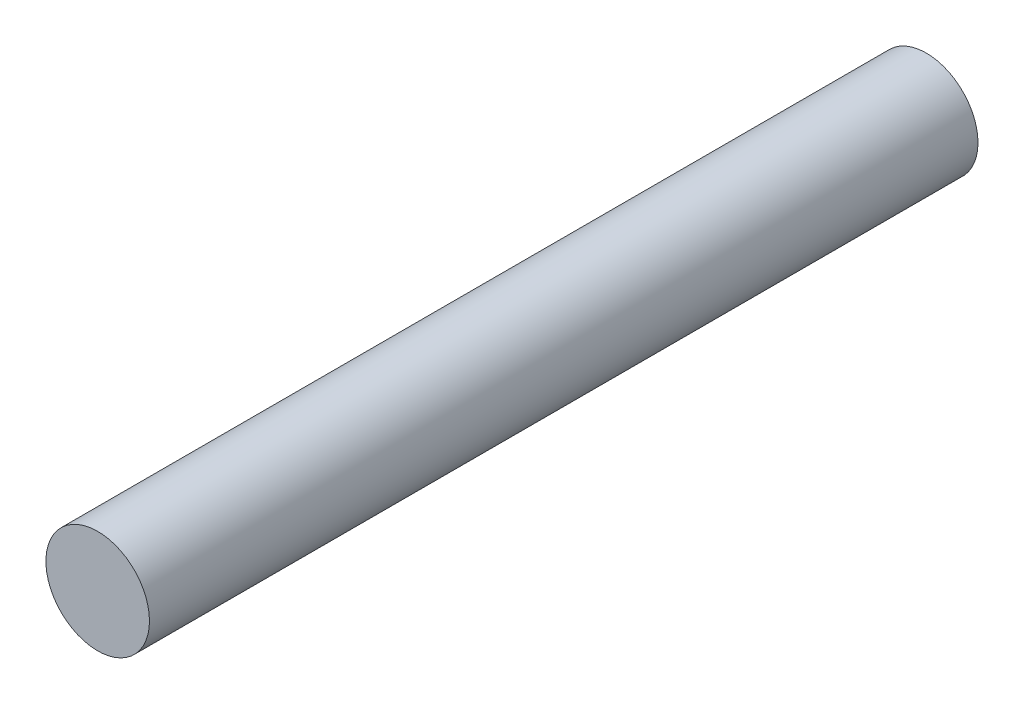
ISO-10303-21;
HEADER;
FILE_DESCRIPTION(('STEP AP214'),'2;1');
FILE_NAME('part.step','',(''),(''),'','','');
FILE_SCHEMA(('AUTOMOTIVE_DESIGN { 1 0 10303 214 1 1 1 1 }'));
ENDSEC;
DATA;
#1=APPLICATION_CONTEXT('core data for automotive mechanical design processes');
#2=APPLICATION_PROTOCOL_DEFINITION('international standard','automotive_design',2000,#1);
#3=PRODUCT_CONTEXT('',#1,'mechanical');
#4=PRODUCT('Part','Part','',(#3));
#5=PRODUCT_RELATED_PRODUCT_CATEGORY('part','',(#4));
#6=PRODUCT_DEFINITION_FORMATION('','',#4);
#7=PRODUCT_DEFINITION_CONTEXT('part definition',#1,'design');
#8=PRODUCT_DEFINITION('design','',#6,#7);
#9=PRODUCT_DEFINITION_SHAPE('','',#8);
#10=(LENGTH_UNIT() NAMED_UNIT(*) SI_UNIT(.MILLI.,.METRE.));
#11=(NAMED_UNIT(*) PLANE_ANGLE_UNIT() SI_UNIT($,.RADIAN.));
#12=(NAMED_UNIT(*) SI_UNIT($,.STERADIAN.) SOLID_ANGLE_UNIT());
#13=UNCERTAINTY_MEASURE_WITH_UNIT(LENGTH_MEASURE(1.E-05),#10,'distance_accuracy_value','');
#14=(GEOMETRIC_REPRESENTATION_CONTEXT(3) GLOBAL_UNCERTAINTY_ASSIGNED_CONTEXT((#13)) GLOBAL_UNIT_ASSIGNED_CONTEXT((#10,
#11,#12)) REPRESENTATION_CONTEXT('',''));
#15=CARTESIAN_POINT('',(0.,0.,0.));
#16=DIRECTION('',(0.,0.,1.));
#17=DIRECTION('',(1.,0.,0.));
#18=AXIS2_PLACEMENT_3D('',#15,#16,#17);
#19=CARTESIAN_POINT('',(0.,0.,25.4));
#20=DIRECTION('',(0.,0.,-1.));
#21=DIRECTION('',(-1.,0.,0.));
#22=AXIS2_PLACEMENT_3D('',#19,#20,#21);
#23=CYLINDRICAL_SURFACE('',#22,3.175);
#24=CARTESIAN_POINT('',(0.,0.,25.4));
#25=DIRECTION('',(0.,0.,1.));
#26=DIRECTION('',(1.,0.,0.));
#27=AXIS2_PLACEMENT_3D('',#24,#25,#26);
#28=CIRCLE('',#27,3.175);
#29=CARTESIAN_POINT('',(3.175,0.,25.4));
#30=VERTEX_POINT('',#29);
#31=EDGE_CURVE('E10',#30,#30,#28,.T.);
#32=ORIENTED_EDGE('',*,*,#31,.F.);
#33=EDGE_LOOP('',(#32));
#34=FACE_BOUND('',#33,.T.);
#35=CARTESIAN_POINT('',(0.,0.,-25.4));
#36=DIRECTION('',(0.,0.,1.));
#37=DIRECTION('',(1.,0.,0.));
#38=AXIS2_PLACEMENT_3D('',#35,#36,#37);
#39=CIRCLE('',#38,3.175);
#40=CARTESIAN_POINT('',(3.175,0.,-25.4));
#41=VERTEX_POINT('',#40);
#42=EDGE_CURVE('E40',#41,#41,#39,.T.);
#43=ORIENTED_EDGE('',*,*,#42,.T.);
#44=EDGE_LOOP('',(#43));
#45=FACE_BOUND('',#44,.T.);
#46=ADVANCED_FACE('F37',(#34,#45),#23,.T.);
#47=CARTESIAN_POINT('',(0.,0.,25.4));
#48=DIRECTION('',(0.,0.,1.));
#49=DIRECTION('',(1.,0.,0.));
#50=AXIS2_PLACEMENT_3D('',#47,#48,#49);
#51=PLANE('',#50);
#52=ORIENTED_EDGE('',*,*,#31,.T.);
#53=EDGE_LOOP('',(#52));
#54=FACE_BOUND('',#53,.T.);
#55=ADVANCED_FACE('F54',(#54),#51,.T.);
#56=CARTESIAN_POINT('',(0.,0.,-25.4));
#57=DIRECTION('',(0.,0.,1.));
#58=DIRECTION('',(1.,0.,0.));
#59=AXIS2_PLACEMENT_3D('',#56,#57,#58);
#60=PLANE('',#59);
#61=ORIENTED_EDGE('',*,*,#42,.F.);
#62=EDGE_LOOP('',(#61));
#63=FACE_BOUND('',#62,.T.);
#64=ADVANCED_FACE('F52',(#63),#60,.F.);
#65=CLOSED_SHELL('',(#46,#55,#64));
#66=MANIFOLD_SOLID_BREP('B2',#65);
#67=ADVANCED_BREP_SHAPE_REPRESENTATION('',(#18,#66),#14);
#68=SHAPE_DEFINITION_REPRESENTATION(#9,#67);
ENDSEC;
END-ISO-10303-21;
